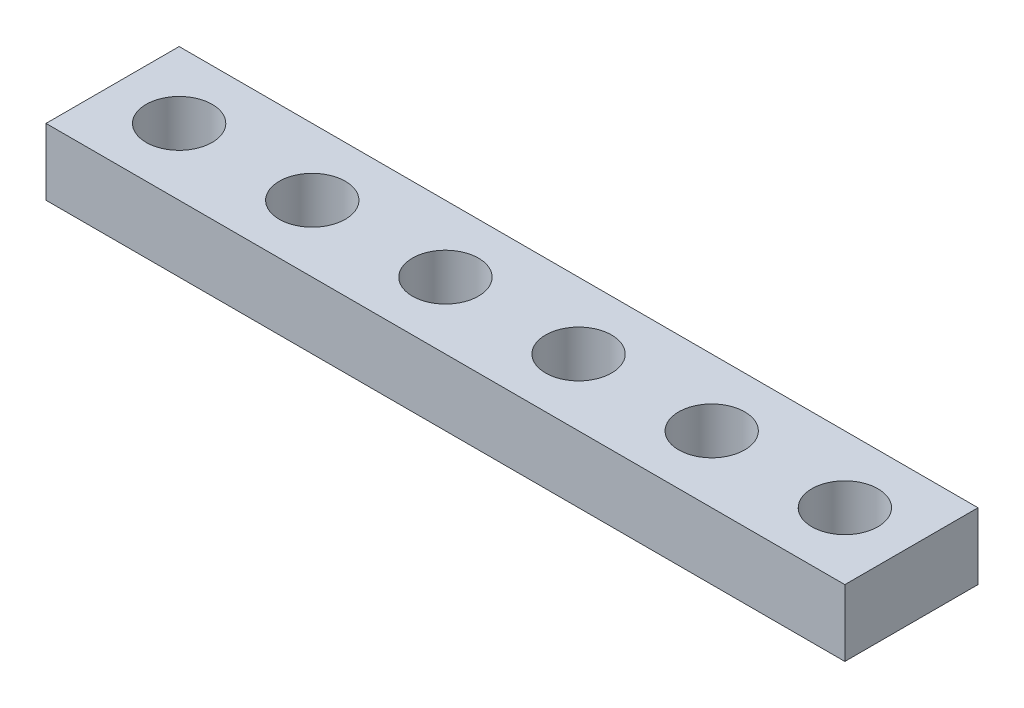
ISO-10303-21;
HEADER;
FILE_DESCRIPTION(('STEP AP214'),'2;1');
FILE_NAME('part.step','',(''),(''),'','','');
FILE_SCHEMA(('AUTOMOTIVE_DESIGN { 1 0 10303 214 1 1 1 1 }'));
ENDSEC;
DATA;
#1=APPLICATION_CONTEXT('core data for automotive mechanical design processes');
#2=APPLICATION_PROTOCOL_DEFINITION('international standard','automotive_design',2000,#1);
#3=PRODUCT_CONTEXT('',#1,'mechanical');
#4=PRODUCT('Part','Part','',(#3));
#5=PRODUCT_RELATED_PRODUCT_CATEGORY('part','',(#4));
#6=PRODUCT_DEFINITION_FORMATION('','',#4);
#7=PRODUCT_DEFINITION_CONTEXT('part definition',#1,'design');
#8=PRODUCT_DEFINITION('design','',#6,#7);
#9=PRODUCT_DEFINITION_SHAPE('','',#8);
#10=(LENGTH_UNIT() NAMED_UNIT(*) SI_UNIT(.MILLI.,.METRE.));
#11=(NAMED_UNIT(*) PLANE_ANGLE_UNIT() SI_UNIT($,.RADIAN.));
#12=(NAMED_UNIT(*) SI_UNIT($,.STERADIAN.) SOLID_ANGLE_UNIT());
#13=UNCERTAINTY_MEASURE_WITH_UNIT(LENGTH_MEASURE(1.E-05),#10,'distance_accuracy_value','');
#14=(GEOMETRIC_REPRESENTATION_CONTEXT(3) GLOBAL_UNCERTAINTY_ASSIGNED_CONTEXT((#13)) GLOBAL_UNIT_ASSIGNED_CONTEXT((#10,
#11,#12)) REPRESENTATION_CONTEXT('',''));
#15=CARTESIAN_POINT('',(0.,0.,0.));
#16=DIRECTION('',(0.,0.,1.));
#17=DIRECTION('',(1.,0.,0.));
#18=AXIS2_PLACEMENT_3D('',#15,#16,#17);
#19=CARTESIAN_POINT('',(19.05,3.175,-3.175));
#20=DIRECTION('',(-1.,0.,0.));
#21=DIRECTION('',(0.,0.,1.));
#22=AXIS2_PLACEMENT_3D('',#19,#20,#21);
#23=PLANE('',#22);
#24=DIRECTION('',(0.,0.,-1.));
#25=VECTOR('',#24,1.);
#26=CARTESIAN_POINT('',(19.05,0.,-3.175));
#27=LINE('',#26,#25);
#28=CARTESIAN_POINT('',(19.05,0.,3.175));
#29=VERTEX_POINT('',#28);
#30=CARTESIAN_POINT('',(19.05,0.,-3.175));
#31=VERTEX_POINT('',#30);
#32=EDGE_CURVE('E102',#29,#31,#27,.T.);
#33=ORIENTED_EDGE('',*,*,#32,.T.);
#34=DIRECTION('',(0.,-1.,0.));
#35=VECTOR('',#34,1.);
#36=CARTESIAN_POINT('',(19.05,3.175,-3.175));
#37=LINE('',#36,#35);
#38=CARTESIAN_POINT('',(19.05,3.175,-3.175));
#39=VERTEX_POINT('',#38);
#40=EDGE_CURVE('E93',#39,#31,#37,.T.);
#41=ORIENTED_EDGE('',*,*,#40,.F.);
#42=DIRECTION('',(0.,0.,-1.));
#43=VECTOR('',#42,1.);
#44=CARTESIAN_POINT('',(19.05,3.175,-3.175));
#45=LINE('',#44,#43);
#46=CARTESIAN_POINT('',(19.05,3.175,3.175));
#47=VERTEX_POINT('',#46);
#48=EDGE_CURVE('E87',#47,#39,#45,.T.);
#49=ORIENTED_EDGE('',*,*,#48,.F.);
#50=DIRECTION('',(0.,-1.,0.));
#51=VECTOR('',#50,1.);
#52=CARTESIAN_POINT('',(19.05,3.175,3.175));
#53=LINE('',#52,#51);
#54=EDGE_CURVE('E98',#47,#29,#53,.T.);
#55=ORIENTED_EDGE('',*,*,#54,.T.);
#56=EDGE_LOOP('',(#33,#41,#49,#55));
#57=FACE_BOUND('',#56,.T.);
#58=ADVANCED_FACE('F33',(#57),#23,.F.);
#59=CARTESIAN_POINT('',(-19.05,3.175,-3.175));
#60=DIRECTION('',(0.,0.,1.));
#61=DIRECTION('',(1.,0.,0.));
#62=AXIS2_PLACEMENT_3D('',#59,#60,#61);
#63=PLANE('',#62);
#64=DIRECTION('',(-1.,0.,0.));
#65=VECTOR('',#64,1.);
#66=CARTESIAN_POINT('',(-19.05,0.,-3.175));
#67=LINE('',#66,#65);
#68=CARTESIAN_POINT('',(-19.05,0.,-3.175));
#69=VERTEX_POINT('',#68);
#70=EDGE_CURVE('E92',#31,#69,#67,.T.);
#71=ORIENTED_EDGE('',*,*,#70,.T.);
#72=DIRECTION('',(0.,-1.,0.));
#73=VECTOR('',#72,1.);
#74=CARTESIAN_POINT('',(-19.05,3.175,-3.175));
#75=LINE('',#74,#73);
#76=CARTESIAN_POINT('',(-19.05,3.175,-3.175));
#77=VERTEX_POINT('',#76);
#78=EDGE_CURVE('E90',#77,#69,#75,.T.);
#79=ORIENTED_EDGE('',*,*,#78,.F.);
#80=DIRECTION('',(-1.,0.,0.));
#81=VECTOR('',#80,1.);
#82=CARTESIAN_POINT('',(-19.05,3.175,-3.175));
#83=LINE('',#82,#81);
#84=EDGE_CURVE('E81',#39,#77,#83,.T.);
#85=ORIENTED_EDGE('',*,*,#84,.F.);
#86=ORIENTED_EDGE('',*,*,#40,.T.);
#87=EDGE_LOOP('',(#71,#79,#85,#86));
#88=FACE_BOUND('',#87,.T.);
#89=ADVANCED_FACE('F91',(#88),#63,.F.);
#90=CARTESIAN_POINT('',(-19.05,3.175,-3.175));
#91=DIRECTION('',(1.,0.,0.));
#92=DIRECTION('',(0.,0.,-1.));
#93=AXIS2_PLACEMENT_3D('',#90,#91,#92);
#94=PLANE('',#93);
#95=DIRECTION('',(0.,0.,1.));
#96=VECTOR('',#95,1.);
#97=CARTESIAN_POINT('',(-19.05,0.,-3.175));
#98=LINE('',#97,#96);
#99=CARTESIAN_POINT('',(-19.05,0.,3.175));
#100=VERTEX_POINT('',#99);
#101=EDGE_CURVE('E67',#69,#100,#98,.T.);
#102=ORIENTED_EDGE('',*,*,#101,.T.);
#103=DIRECTION('',(0.,-1.,0.));
#104=VECTOR('',#103,1.);
#105=CARTESIAN_POINT('',(-19.05,3.175,3.175));
#106=LINE('',#105,#104);
#107=CARTESIAN_POINT('',(-19.05,3.175,3.175));
#108=VERTEX_POINT('',#107);
#109=EDGE_CURVE('E94',#108,#100,#106,.T.);
#110=ORIENTED_EDGE('',*,*,#109,.F.);
#111=DIRECTION('',(0.,0.,1.));
#112=VECTOR('',#111,1.);
#113=CARTESIAN_POINT('',(-19.05,3.175,-3.175));
#114=LINE('',#113,#112);
#115=EDGE_CURVE('E85',#77,#108,#114,.T.);
#116=ORIENTED_EDGE('',*,*,#115,.F.);
#117=ORIENTED_EDGE('',*,*,#78,.T.);
#118=EDGE_LOOP('',(#102,#110,#116,#117));
#119=FACE_BOUND('',#118,.T.);
#120=ADVANCED_FACE('F96',(#119),#94,.F.);
#121=CARTESIAN_POINT('',(-19.05,3.175,3.175));
#122=DIRECTION('',(0.,0.,-1.));
#123=DIRECTION('',(-1.,0.,0.));
#124=AXIS2_PLACEMENT_3D('',#121,#122,#123);
#125=PLANE('',#124);
#126=DIRECTION('',(1.,0.,0.));
#127=VECTOR('',#126,1.);
#128=CARTESIAN_POINT('',(-19.05,0.,3.175));
#129=LINE('',#128,#127);
#130=EDGE_CURVE('E73',#100,#29,#129,.T.);
#131=ORIENTED_EDGE('',*,*,#130,.T.);
#132=ORIENTED_EDGE('',*,*,#54,.F.);
#133=DIRECTION('',(1.,0.,0.));
#134=VECTOR('',#133,1.);
#135=CARTESIAN_POINT('',(-19.05,3.175,3.175));
#136=LINE('',#135,#134);
#137=EDGE_CURVE('E50',#108,#47,#136,.T.);
#138=ORIENTED_EDGE('',*,*,#137,.F.);
#139=ORIENTED_EDGE('',*,*,#109,.T.);
#140=EDGE_LOOP('',(#131,#132,#138,#139));
#141=FACE_BOUND('',#140,.T.);
#142=ADVANCED_FACE('F140',(#141),#125,.F.);
#143=CARTESIAN_POINT('',(0.,3.175,0.));
#144=DIRECTION('',(0.,1.,0.));
#145=DIRECTION('',(0.,0.,1.));
#146=AXIS2_PLACEMENT_3D('',#143,#144,#145);
#147=PLANE('',#146);
#148=CARTESIAN_POINT('',(9.525,3.175,0.));
#149=DIRECTION('',(0.,1.,0.));
#150=DIRECTION('',(0.,0.,1.));
#151=AXIS2_PLACEMENT_3D('',#148,#149,#150);
#152=CIRCLE('',#151,1.5748);
#153=CARTESIAN_POINT('',(9.525,3.175,1.5748));
#154=VERTEX_POINT('',#153);
#155=EDGE_CURVE('E258',#154,#154,#152,.T.);
#156=ORIENTED_EDGE('',*,*,#155,.F.);
#157=EDGE_LOOP('',(#156));
#158=FACE_BOUND('',#157,.T.);
#159=CARTESIAN_POINT('',(15.875,3.175,0.));
#160=DIRECTION('',(0.,1.,0.));
#161=DIRECTION('',(0.,0.,1.));
#162=AXIS2_PLACEMENT_3D('',#159,#160,#161);
#163=CIRCLE('',#162,1.5748);
#164=CARTESIAN_POINT('',(15.875,3.175,1.5748));
#165=VERTEX_POINT('',#164);
#166=EDGE_CURVE('E257',#165,#165,#163,.T.);
#167=ORIENTED_EDGE('',*,*,#166,.F.);
#168=EDGE_LOOP('',(#167));
#169=FACE_BOUND('',#168,.T.);
#170=ORIENTED_EDGE('',*,*,#48,.T.);
#171=ORIENTED_EDGE('',*,*,#84,.T.);
#172=ORIENTED_EDGE('',*,*,#115,.T.);
#173=ORIENTED_EDGE('',*,*,#137,.T.);
#174=EDGE_LOOP('',(#170,#171,#172,#173));
#175=FACE_BOUND('',#174,.T.);
#176=CARTESIAN_POINT('',(3.175,3.175,0.));
#177=DIRECTION('',(0.,1.,0.));
#178=DIRECTION('',(0.,0.,1.));
#179=AXIS2_PLACEMENT_3D('',#176,#177,#178);
#180=CIRCLE('',#179,1.5748);
#181=CARTESIAN_POINT('',(3.175,3.175,1.5748));
#182=VERTEX_POINT('',#181);
#183=EDGE_CURVE('E115',#182,#182,#180,.T.);
#184=ORIENTED_EDGE('',*,*,#183,.F.);
#185=EDGE_LOOP('',(#184));
#186=FACE_BOUND('',#185,.T.);
#187=CARTESIAN_POINT('',(-3.17499999999999,3.175,0.));
#188=DIRECTION('',(0.,1.,0.));
#189=DIRECTION('',(0.,0.,1.));
#190=AXIS2_PLACEMENT_3D('',#187,#188,#189);
#191=CIRCLE('',#190,1.5748);
#192=CARTESIAN_POINT('',(-3.17499999999999,3.175,1.5748));
#193=VERTEX_POINT('',#192);
#194=EDGE_CURVE('E121',#193,#193,#191,.T.);
#195=ORIENTED_EDGE('',*,*,#194,.F.);
#196=EDGE_LOOP('',(#195));
#197=FACE_BOUND('',#196,.T.);
#198=CARTESIAN_POINT('',(-9.52499999999999,3.175,0.));
#199=DIRECTION('',(0.,1.,0.));
#200=DIRECTION('',(0.,0.,1.));
#201=AXIS2_PLACEMENT_3D('',#198,#199,#200);
#202=CIRCLE('',#201,1.5748);
#203=CARTESIAN_POINT('',(-9.52499999999999,3.175,1.5748));
#204=VERTEX_POINT('',#203);
#205=EDGE_CURVE('E127',#204,#204,#202,.T.);
#206=ORIENTED_EDGE('',*,*,#205,.F.);
#207=EDGE_LOOP('',(#206));
#208=FACE_BOUND('',#207,.T.);
#209=CARTESIAN_POINT('',(-15.875,3.175,0.));
#210=DIRECTION('',(0.,1.,0.));
#211=DIRECTION('',(0.,0.,1.));
#212=AXIS2_PLACEMENT_3D('',#209,#210,#211);
#213=CIRCLE('',#212,1.5748);
#214=CARTESIAN_POINT('',(-15.875,3.175,1.5748));
#215=VERTEX_POINT('',#214);
#216=EDGE_CURVE('E11',#215,#215,#213,.T.);
#217=ORIENTED_EDGE('',*,*,#216,.F.);
#218=EDGE_LOOP('',(#217));
#219=FACE_BOUND('',#218,.T.);
#220=ADVANCED_FACE('F82',(#158,#169,#175,#186,#197,#208,#219),#147,.T.);
#221=CARTESIAN_POINT('',(0.,0.,0.));
#222=DIRECTION('',(0.,1.,0.));
#223=DIRECTION('',(0.,0.,1.));
#224=AXIS2_PLACEMENT_3D('',#221,#222,#223);
#225=PLANE('',#224);
#226=CARTESIAN_POINT('',(9.525,0.,0.));
#227=DIRECTION('',(0.,1.,0.));
#228=DIRECTION('',(0.,0.,1.));
#229=AXIS2_PLACEMENT_3D('',#226,#227,#228);
#230=CIRCLE('',#229,1.5748);
#231=CARTESIAN_POINT('',(9.525,0.,1.5748));
#232=VERTEX_POINT('',#231);
#233=EDGE_CURVE('E262',#232,#232,#230,.T.);
#234=ORIENTED_EDGE('',*,*,#233,.T.);
#235=EDGE_LOOP('',(#234));
#236=FACE_BOUND('',#235,.T.);
#237=CARTESIAN_POINT('',(15.875,0.,0.));
#238=DIRECTION('',(0.,1.,0.));
#239=DIRECTION('',(0.,0.,1.));
#240=AXIS2_PLACEMENT_3D('',#237,#238,#239);
#241=CIRCLE('',#240,1.5748);
#242=CARTESIAN_POINT('',(15.875,0.,1.5748));
#243=VERTEX_POINT('',#242);
#244=EDGE_CURVE('E105',#243,#243,#241,.T.);
#245=ORIENTED_EDGE('',*,*,#244,.T.);
#246=EDGE_LOOP('',(#245));
#247=FACE_BOUND('',#246,.T.);
#248=ORIENTED_EDGE('',*,*,#32,.F.);
#249=ORIENTED_EDGE('',*,*,#130,.F.);
#250=ORIENTED_EDGE('',*,*,#101,.F.);
#251=ORIENTED_EDGE('',*,*,#70,.F.);
#252=EDGE_LOOP('',(#248,#249,#250,#251));
#253=FACE_BOUND('',#252,.T.);
#254=CARTESIAN_POINT('',(3.175,0.,0.));
#255=DIRECTION('',(0.,1.,0.));
#256=DIRECTION('',(0.,0.,1.));
#257=AXIS2_PLACEMENT_3D('',#254,#255,#256);
#258=CIRCLE('',#257,1.5748);
#259=CARTESIAN_POINT('',(3.175,0.,1.5748));
#260=VERTEX_POINT('',#259);
#261=EDGE_CURVE('E112',#260,#260,#258,.T.);
#262=ORIENTED_EDGE('',*,*,#261,.T.);
#263=EDGE_LOOP('',(#262));
#264=FACE_BOUND('',#263,.T.);
#265=CARTESIAN_POINT('',(-3.17499999999999,0.,0.));
#266=DIRECTION('',(0.,1.,0.));
#267=DIRECTION('',(0.,0.,1.));
#268=AXIS2_PLACEMENT_3D('',#265,#266,#267);
#269=CIRCLE('',#268,1.5748);
#270=CARTESIAN_POINT('',(-3.17499999999999,0.,1.5748));
#271=VERTEX_POINT('',#270);
#272=EDGE_CURVE('E118',#271,#271,#269,.T.);
#273=ORIENTED_EDGE('',*,*,#272,.T.);
#274=EDGE_LOOP('',(#273));
#275=FACE_BOUND('',#274,.T.);
#276=CARTESIAN_POINT('',(-9.52499999999999,0.,0.));
#277=DIRECTION('',(0.,1.,0.));
#278=DIRECTION('',(0.,0.,1.));
#279=AXIS2_PLACEMENT_3D('',#276,#277,#278);
#280=CIRCLE('',#279,1.5748);
#281=CARTESIAN_POINT('',(-9.52499999999999,0.,1.5748));
#282=VERTEX_POINT('',#281);
#283=EDGE_CURVE('E124',#282,#282,#280,.T.);
#284=ORIENTED_EDGE('',*,*,#283,.T.);
#285=EDGE_LOOP('',(#284));
#286=FACE_BOUND('',#285,.T.);
#287=CARTESIAN_POINT('',(-15.875,0.,0.));
#288=DIRECTION('',(0.,1.,0.));
#289=DIRECTION('',(0.,0.,1.));
#290=AXIS2_PLACEMENT_3D('',#287,#288,#289);
#291=CIRCLE('',#290,1.5748);
#292=CARTESIAN_POINT('',(-15.875,0.,1.5748));
#293=VERTEX_POINT('',#292);
#294=EDGE_CURVE('E42',#293,#293,#291,.T.);
#295=ORIENTED_EDGE('',*,*,#294,.T.);
#296=EDGE_LOOP('',(#295));
#297=FACE_BOUND('',#296,.T.);
#298=ADVANCED_FACE('F132',(#236,#247,#253,#264,#275,#286,#297),#225,.F.);
#299=CARTESIAN_POINT('',(15.875,0.,0.));
#300=DIRECTION('',(0.,1.,0.));
#301=DIRECTION('',(0.,0.,1.));
#302=AXIS2_PLACEMENT_3D('',#299,#300,#301);
#303=CYLINDRICAL_SURFACE('',#302,1.5748);
#304=ORIENTED_EDGE('',*,*,#244,.F.);
#305=EDGE_LOOP('',(#304));
#306=FACE_BOUND('',#305,.T.);
#307=ORIENTED_EDGE('',*,*,#166,.T.);
#308=EDGE_LOOP('',(#307));
#309=FACE_BOUND('',#308,.T.);
#310=ADVANCED_FACE('F147',(#306,#309),#303,.F.);
#311=CARTESIAN_POINT('',(9.525,0.,0.));
#312=DIRECTION('',(0.,1.,0.));
#313=DIRECTION('',(0.,0.,1.));
#314=AXIS2_PLACEMENT_3D('',#311,#312,#313);
#315=CYLINDRICAL_SURFACE('',#314,1.5748);
#316=ORIENTED_EDGE('',*,*,#233,.F.);
#317=EDGE_LOOP('',(#316));
#318=FACE_BOUND('',#317,.T.);
#319=ORIENTED_EDGE('',*,*,#155,.T.);
#320=EDGE_LOOP('',(#319));
#321=FACE_BOUND('',#320,.T.);
#322=ADVANCED_FACE('F167',(#318,#321),#315,.F.);
#323=CARTESIAN_POINT('',(3.175,0.,0.));
#324=DIRECTION('',(0.,1.,0.));
#325=DIRECTION('',(0.,0.,1.));
#326=AXIS2_PLACEMENT_3D('',#323,#324,#325);
#327=CYLINDRICAL_SURFACE('',#326,1.5748);
#328=ORIENTED_EDGE('',*,*,#261,.F.);
#329=EDGE_LOOP('',(#328));
#330=FACE_BOUND('',#329,.T.);
#331=ORIENTED_EDGE('',*,*,#183,.T.);
#332=EDGE_LOOP('',(#331));
#333=FACE_BOUND('',#332,.T.);
#334=ADVANCED_FACE('F163',(#330,#333),#327,.F.);
#335=CARTESIAN_POINT('',(-3.17499999999999,0.,0.));
#336=DIRECTION('',(0.,1.,0.));
#337=DIRECTION('',(0.,0.,1.));
#338=AXIS2_PLACEMENT_3D('',#335,#336,#337);
#339=CYLINDRICAL_SURFACE('',#338,1.5748);
#340=ORIENTED_EDGE('',*,*,#272,.F.);
#341=EDGE_LOOP('',(#340));
#342=FACE_BOUND('',#341,.T.);
#343=ORIENTED_EDGE('',*,*,#194,.T.);
#344=EDGE_LOOP('',(#343));
#345=FACE_BOUND('',#344,.T.);
#346=ADVANCED_FACE('F166',(#342,#345),#339,.F.);
#347=CARTESIAN_POINT('',(-9.52499999999999,0.,0.));
#348=DIRECTION('',(0.,1.,0.));
#349=DIRECTION('',(0.,0.,1.));
#350=AXIS2_PLACEMENT_3D('',#347,#348,#349);
#351=CYLINDRICAL_SURFACE('',#350,1.5748);
#352=ORIENTED_EDGE('',*,*,#283,.F.);
#353=EDGE_LOOP('',(#352));
#354=FACE_BOUND('',#353,.T.);
#355=ORIENTED_EDGE('',*,*,#205,.T.);
#356=EDGE_LOOP('',(#355));
#357=FACE_BOUND('',#356,.T.);
#358=ADVANCED_FACE('F136',(#354,#357),#351,.F.);
#359=CARTESIAN_POINT('',(-15.875,0.,0.));
#360=DIRECTION('',(0.,1.,0.));
#361=DIRECTION('',(0.,0.,1.));
#362=AXIS2_PLACEMENT_3D('',#359,#360,#361);
#363=CYLINDRICAL_SURFACE('',#362,1.5748);
#364=ORIENTED_EDGE('',*,*,#294,.F.);
#365=EDGE_LOOP('',(#364));
#366=FACE_BOUND('',#365,.T.);
#367=ORIENTED_EDGE('',*,*,#216,.T.);
#368=EDGE_LOOP('',(#367));
#369=FACE_BOUND('',#368,.T.);
#370=ADVANCED_FACE('F35',(#366,#369),#363,.F.);
#371=CLOSED_SHELL('',(#58,#89,#120,#142,#220,#298,#310,#322,#334,#346,#358,#370));
#372=MANIFOLD_SOLID_BREP('B2',#371);
#373=ADVANCED_BREP_SHAPE_REPRESENTATION('',(#18,#372),#14);
#374=SHAPE_DEFINITION_REPRESENTATION(#9,#373);
ENDSEC;
END-ISO-10303-21;
